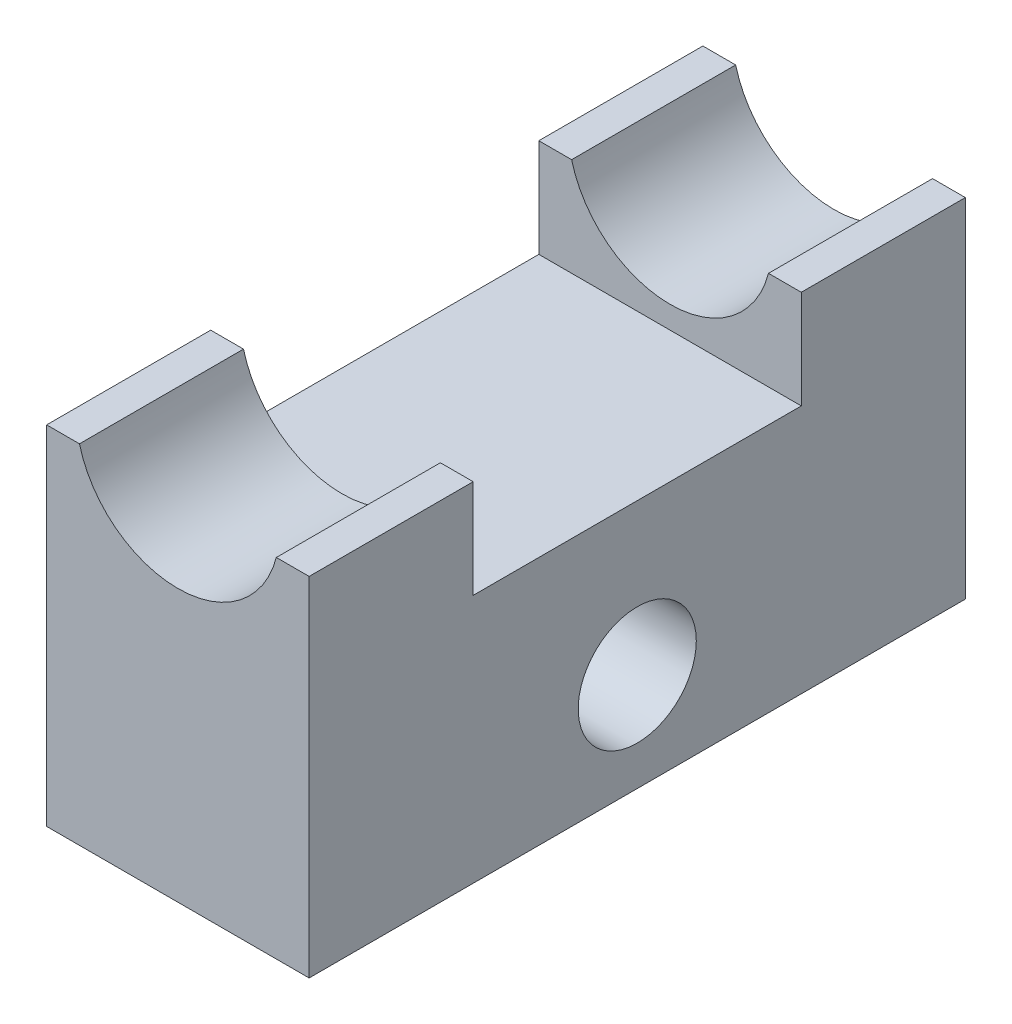
ISO-10303-21;
HEADER;
FILE_DESCRIPTION(('STEP AP214'),'2;1');
FILE_NAME('part.step','',(''),(''),'','','');
FILE_SCHEMA(('AUTOMOTIVE_DESIGN { 1 0 10303 214 1 1 1 1 }'));
ENDSEC;
DATA;
#1=APPLICATION_CONTEXT('core data for automotive mechanical design processes');
#2=APPLICATION_PROTOCOL_DEFINITION('international standard','automotive_design',2000,#1);
#3=PRODUCT_CONTEXT('',#1,'mechanical');
#4=PRODUCT('Part','Part','',(#3));
#5=PRODUCT_RELATED_PRODUCT_CATEGORY('part','',(#4));
#6=PRODUCT_DEFINITION_FORMATION('','',#4);
#7=PRODUCT_DEFINITION_CONTEXT('part definition',#1,'design');
#8=PRODUCT_DEFINITION('design','',#6,#7);
#9=PRODUCT_DEFINITION_SHAPE('','',#8);
#10=(LENGTH_UNIT() NAMED_UNIT(*) SI_UNIT(.MILLI.,.METRE.));
#11=(NAMED_UNIT(*) PLANE_ANGLE_UNIT() SI_UNIT($,.RADIAN.));
#12=(NAMED_UNIT(*) SI_UNIT($,.STERADIAN.) SOLID_ANGLE_UNIT());
#13=UNCERTAINTY_MEASURE_WITH_UNIT(LENGTH_MEASURE(1.E-05),#10,'distance_accuracy_value','');
#14=(GEOMETRIC_REPRESENTATION_CONTEXT(3) GLOBAL_UNCERTAINTY_ASSIGNED_CONTEXT((#13)) GLOBAL_UNIT_ASSIGNED_CONTEXT((#10,
#11,#12)) REPRESENTATION_CONTEXT('',''));
#15=CARTESIAN_POINT('',(0.,0.,0.));
#16=DIRECTION('',(0.,0.,1.));
#17=DIRECTION('',(1.,0.,0.));
#18=AXIS2_PLACEMENT_3D('',#15,#16,#17);
#19=CARTESIAN_POINT('',(1040.3924439915,375.619056085452,100.));
#20=DIRECTION('',(0.,-1.,0.));
#21=DIRECTION('',(0.,0.,-1.));
#22=AXIS2_PLACEMENT_3D('',#19,#20,#21);
#23=PLANE('',#22);
#24=DIRECTION('',(0.,0.,-1.));
#25=VECTOR('',#24,1.);
#26=CARTESIAN_POINT('',(1040.3924439915,375.619056085452,100.));
#27=LINE('',#26,#25);
#28=CARTESIAN_POINT('',(1040.3924439915,375.619056085452,100.));
#29=VERTEX_POINT('',#28);
#30=CARTESIAN_POINT('',(1040.3924439915,375.619056085452,75.));
#31=VERTEX_POINT('',#30);
#32=EDGE_CURVE('E159',#29,#31,#27,.T.);
#33=ORIENTED_EDGE('',*,*,#32,.T.);
#34=DIRECTION('',(1.,0.,0.));
#35=VECTOR('',#34,1.);
#36=CARTESIAN_POINT('',(940.392443991503,375.619056085452,75.));
#37=LINE('',#36,#35);
#38=CARTESIAN_POINT('',(1035.3924439915,375.619056085452,75.));
#39=VERTEX_POINT('',#38);
#40=EDGE_CURVE('E228',#39,#31,#37,.T.);
#41=ORIENTED_EDGE('',*,*,#40,.F.);
#42=DIRECTION('',(0.,0.,-1.));
#43=VECTOR('',#42,1.);
#44=CARTESIAN_POINT('',(1035.3924439915,375.619056085452,100.));
#45=LINE('',#44,#43);
#46=CARTESIAN_POINT('',(1035.3924439915,375.619056085452,100.));
#47=VERTEX_POINT('',#46);
#48=EDGE_CURVE('E156',#47,#39,#45,.T.);
#49=ORIENTED_EDGE('',*,*,#48,.F.);
#50=DIRECTION('',(-1.,0.,0.));
#51=VECTOR('',#50,1.);
#52=CARTESIAN_POINT('',(1040.3924439915,375.619056085452,100.));
#53=LINE('',#52,#51);
#54=EDGE_CURVE('E110',#29,#47,#53,.T.);
#55=ORIENTED_EDGE('',*,*,#54,.F.);
#56=EDGE_LOOP('',(#33,#41,#49,#55));
#57=FACE_BOUND('',#56,.T.);
#58=ADVANCED_FACE('F35',(#57),#23,.F.);
#59=CARTESIAN_POINT('',(1020.3924439915,379.524180923406,100.));
#60=DIRECTION('',(0.,0.,-1.));
#61=DIRECTION('',(-1.,0.,0.));
#62=AXIS2_PLACEMENT_3D('',#59,#60,#61);
#63=CYLINDRICAL_SURFACE('',#62,15.5000000000001);
#64=ORIENTED_EDGE('',*,*,#48,.T.);
#65=CARTESIAN_POINT('',(1020.3924439915,379.524180923406,75.));
#66=DIRECTION('',(0.,0.,1.));
#67=DIRECTION('',(0.,-1.,0.));
#68=AXIS2_PLACEMENT_3D('',#65,#66,#67);
#69=CIRCLE('',#68,15.5000000000001);
#70=CARTESIAN_POINT('',(1005.3924439915,375.619056085452,75.));
#71=VERTEX_POINT('',#70);
#72=EDGE_CURVE('E121',#39,#71,#69,.F.);
#73=ORIENTED_EDGE('',*,*,#72,.T.);
#74=DIRECTION('',(0.,0.,-1.));
#75=VECTOR('',#74,1.);
#76=CARTESIAN_POINT('',(1005.3924439915,375.619056085452,100.));
#77=LINE('',#76,#75);
#78=CARTESIAN_POINT('',(1005.3924439915,375.619056085452,100.));
#79=VERTEX_POINT('',#78);
#80=EDGE_CURVE('E117',#79,#71,#77,.T.);
#81=ORIENTED_EDGE('',*,*,#80,.F.);
#82=CARTESIAN_POINT('',(1020.3924439915,379.524180923406,100.));
#83=DIRECTION('',(0.,0.,-1.));
#84=DIRECTION('',(1.,0.,0.));
#85=AXIS2_PLACEMENT_3D('',#82,#83,#84);
#86=CIRCLE('',#85,15.5000000000001);
#87=EDGE_CURVE('E103',#47,#79,#86,.T.);
#88=ORIENTED_EDGE('',*,*,#87,.F.);
#89=EDGE_LOOP('',(#64,#73,#81,#88));
#90=FACE_BOUND('',#89,.T.);
#91=ADVANCED_FACE('F118',(#90),#63,.F.);
#92=CARTESIAN_POINT('',(1005.3924439915,375.619056085452,100.));
#93=DIRECTION('',(0.,-1.,0.));
#94=DIRECTION('',(0.,0.,-1.));
#95=AXIS2_PLACEMENT_3D('',#92,#93,#94);
#96=PLANE('',#95);
#97=ORIENTED_EDGE('',*,*,#80,.T.);
#98=CARTESIAN_POINT('',(1000.3924439915,375.619056085452,75.));
#99=VERTEX_POINT('',#98);
#100=EDGE_CURVE('E236',#99,#71,#37,.T.);
#101=ORIENTED_EDGE('',*,*,#100,.F.);
#102=DIRECTION('',(0.,0.,-1.));
#103=VECTOR('',#102,1.);
#104=CARTESIAN_POINT('',(1000.3924439915,375.619056085452,100.));
#105=LINE('',#104,#103);
#106=CARTESIAN_POINT('',(1000.3924439915,375.619056085452,100.));
#107=VERTEX_POINT('',#106);
#108=EDGE_CURVE('E129',#107,#99,#105,.T.);
#109=ORIENTED_EDGE('',*,*,#108,.F.);
#110=DIRECTION('',(-1.,0.,0.));
#111=VECTOR('',#110,1.);
#112=CARTESIAN_POINT('',(1005.3924439915,375.619056085452,100.));
#113=LINE('',#112,#111);
#114=EDGE_CURVE('E107',#79,#107,#113,.T.);
#115=ORIENTED_EDGE('',*,*,#114,.F.);
#116=EDGE_LOOP('',(#97,#101,#109,#115));
#117=FACE_BOUND('',#116,.T.);
#118=ADVANCED_FACE('F127',(#117),#96,.F.);
#119=CARTESIAN_POINT('',(1000.3924439915,322.619056085452,100.));
#120=DIRECTION('',(0.,1.,0.));
#121=DIRECTION('',(0.,0.,1.));
#122=AXIS2_PLACEMENT_3D('',#119,#120,#121);
#123=PLANE('',#122);
#124=DIRECTION('',(1.,0.,0.));
#125=VECTOR('',#124,1.);
#126=CARTESIAN_POINT('',(1000.3924439915,322.619056085452,0.));
#127=LINE('',#126,#125);
#128=CARTESIAN_POINT('',(1000.3924439915,322.619056085452,0.));
#129=VERTEX_POINT('',#128);
#130=CARTESIAN_POINT('',(1040.3924439915,322.619056085452,0.));
#131=VERTEX_POINT('',#130);
#132=EDGE_CURVE('E135',#129,#131,#127,.T.);
#133=ORIENTED_EDGE('',*,*,#132,.T.);
#134=DIRECTION('',(0.,0.,-1.));
#135=VECTOR('',#134,1.);
#136=CARTESIAN_POINT('',(1040.3924439915,322.619056085452,100.));
#137=LINE('',#136,#135);
#138=CARTESIAN_POINT('',(1040.3924439915,322.619056085452,100.));
#139=VERTEX_POINT('',#138);
#140=EDGE_CURVE('E162',#139,#131,#137,.T.);
#141=ORIENTED_EDGE('',*,*,#140,.F.);
#142=DIRECTION('',(1.,0.,0.));
#143=VECTOR('',#142,1.);
#144=CARTESIAN_POINT('',(1000.3924439915,322.619056085452,100.));
#145=LINE('',#144,#143);
#146=CARTESIAN_POINT('',(1000.3924439915,322.619056085452,100.));
#147=VERTEX_POINT('',#146);
#148=EDGE_CURVE('E152',#147,#139,#145,.T.);
#149=ORIENTED_EDGE('',*,*,#148,.F.);
#150=DIRECTION('',(0.,0.,-1.));
#151=VECTOR('',#150,1.);
#152=CARTESIAN_POINT('',(1000.3924439915,322.619056085452,100.));
#153=LINE('',#152,#151);
#154=EDGE_CURVE('E131',#147,#129,#153,.T.);
#155=ORIENTED_EDGE('',*,*,#154,.T.);
#156=EDGE_LOOP('',(#133,#141,#149,#155));
#157=FACE_BOUND('',#156,.T.);
#158=ADVANCED_FACE('F37',(#157),#123,.F.);
#159=CARTESIAN_POINT('',(1040.3924439915,322.619056085452,100.));
#160=DIRECTION('',(-1.,0.,0.));
#161=DIRECTION('',(0.,0.,1.));
#162=AXIS2_PLACEMENT_3D('',#159,#160,#161);
#163=PLANE('',#162);
#164=CARTESIAN_POINT('',(1040.3924439915,337.619056085452,50.));
#165=DIRECTION('',(1.,0.,0.));
#166=DIRECTION('',(0.,0.,-1.));
#167=AXIS2_PLACEMENT_3D('',#164,#165,#166);
#168=CIRCLE('',#167,9.00000000000001);
#169=CARTESIAN_POINT('',(1040.3924439915,337.619056085452,41.));
#170=VERTEX_POINT('',#169);
#171=EDGE_CURVE('E167',#170,#170,#168,.T.);
#172=ORIENTED_EDGE('',*,*,#171,.F.);
#173=EDGE_LOOP('',(#172));
#174=FACE_BOUND('',#173,.T.);
#175=DIRECTION('',(0.,0.,-1.));
#176=VECTOR('',#175,1.);
#177=CARTESIAN_POINT('',(1040.3924439915,360.619056085452,75.));
#178=LINE('',#177,#176);
#179=CARTESIAN_POINT('',(1040.3924439915,360.619056085452,75.));
#180=VERTEX_POINT('',#179);
#181=CARTESIAN_POINT('',(1040.3924439915,360.619056085452,25.));
#182=VERTEX_POINT('',#181);
#183=EDGE_CURVE('E220',#180,#182,#178,.T.);
#184=ORIENTED_EDGE('',*,*,#183,.F.);
#185=DIRECTION('',(0.,-1.,0.));
#186=VECTOR('',#185,1.);
#187=CARTESIAN_POINT('',(1040.3924439915,375.619056085452,75.));
#188=LINE('',#187,#186);
#189=EDGE_CURVE('E225',#31,#180,#188,.T.);
#190=ORIENTED_EDGE('',*,*,#189,.F.);
#191=ORIENTED_EDGE('',*,*,#32,.F.);
#192=DIRECTION('',(0.,1.,0.));
#193=VECTOR('',#192,1.);
#194=CARTESIAN_POINT('',(1040.3924439915,322.619056085452,100.));
#195=LINE('',#194,#193);
#196=EDGE_CURVE('E94',#139,#29,#195,.T.);
#197=ORIENTED_EDGE('',*,*,#196,.F.);
#198=ORIENTED_EDGE('',*,*,#140,.T.);
#199=DIRECTION('',(0.,1.,0.));
#200=VECTOR('',#199,1.);
#201=CARTESIAN_POINT('',(1040.3924439915,322.619056085452,0.));
#202=LINE('',#201,#200);
#203=CARTESIAN_POINT('',(1040.3924439915,375.619056085452,0.));
#204=VERTEX_POINT('',#203);
#205=EDGE_CURVE('E138',#131,#204,#202,.T.);
#206=ORIENTED_EDGE('',*,*,#205,.T.);
#207=CARTESIAN_POINT('',(1040.3924439915,375.619056085452,25.));
#208=VERTEX_POINT('',#207);
#209=EDGE_CURVE('E158',#208,#204,#27,.T.);
#210=ORIENTED_EDGE('',*,*,#209,.F.);
#211=DIRECTION('',(0.,1.,0.));
#212=VECTOR('',#211,1.);
#213=CARTESIAN_POINT('',(1040.3924439915,375.619056085452,25.));
#214=LINE('',#213,#212);
#215=EDGE_CURVE('E222',#182,#208,#214,.T.);
#216=ORIENTED_EDGE('',*,*,#215,.F.);
#217=EDGE_LOOP('',(#184,#190,#191,#197,#198,#206,#210,#216));
#218=FACE_BOUND('',#217,.T.);
#219=ADVANCED_FACE('F230',(#174,#218),#163,.F.);
#220=CARTESIAN_POINT('',(1035.3924439915,375.619056085452,25.));
#221=VERTEX_POINT('',#220);
#222=CARTESIAN_POINT('',(1035.3924439915,375.619056085452,0.));
#223=VERTEX_POINT('',#222);
#224=EDGE_CURVE('E124',#221,#223,#45,.T.);
#225=ORIENTED_EDGE('',*,*,#224,.F.);
#226=DIRECTION('',(1.,0.,0.));
#227=VECTOR('',#226,1.);
#228=CARTESIAN_POINT('',(940.392443991503,375.619056085452,25.));
#229=LINE('',#228,#227);
#230=EDGE_CURVE('E237',#221,#208,#229,.T.);
#231=ORIENTED_EDGE('',*,*,#230,.T.);
#232=ORIENTED_EDGE('',*,*,#209,.T.);
#233=DIRECTION('',(-1.,0.,0.));
#234=VECTOR('',#233,1.);
#235=CARTESIAN_POINT('',(1040.3924439915,375.619056085452,0.));
#236=LINE('',#235,#234);
#237=EDGE_CURVE('E142',#204,#223,#236,.T.);
#238=ORIENTED_EDGE('',*,*,#237,.T.);
#239=EDGE_LOOP('',(#225,#231,#232,#238));
#240=FACE_BOUND('',#239,.T.);
#241=ADVANCED_FACE('F251',(#240),#23,.F.);
#242=CARTESIAN_POINT('',(1005.3924439915,375.619056085452,25.));
#243=VERTEX_POINT('',#242);
#244=CARTESIAN_POINT('',(1005.3924439915,375.619056085452,0.));
#245=VERTEX_POINT('',#244);
#246=EDGE_CURVE('E125',#243,#245,#77,.T.);
#247=ORIENTED_EDGE('',*,*,#246,.F.);
#248=CARTESIAN_POINT('',(1020.3924439915,379.524180923406,25.));
#249=DIRECTION('',(0.,0.,-1.));
#250=DIRECTION('',(-1.,0.,0.));
#251=AXIS2_PLACEMENT_3D('',#248,#249,#250);
#252=CIRCLE('',#251,15.5000000000001);
#253=EDGE_CURVE('E241',#243,#221,#252,.F.);
#254=ORIENTED_EDGE('',*,*,#253,.T.);
#255=ORIENTED_EDGE('',*,*,#224,.T.);
#256=CARTESIAN_POINT('',(1020.3924439915,379.524180923406,0.));
#257=DIRECTION('',(0.,0.,-1.));
#258=DIRECTION('',(1.,0.,0.));
#259=AXIS2_PLACEMENT_3D('',#256,#257,#258);
#260=CIRCLE('',#259,15.5000000000001);
#261=EDGE_CURVE('E145',#223,#245,#260,.T.);
#262=ORIENTED_EDGE('',*,*,#261,.T.);
#263=EDGE_LOOP('',(#247,#254,#255,#262));
#264=FACE_BOUND('',#263,.T.);
#265=ADVANCED_FACE('F256',(#264),#63,.F.);
#266=CARTESIAN_POINT('',(1000.3924439915,375.619056085452,25.));
#267=VERTEX_POINT('',#266);
#268=CARTESIAN_POINT('',(1000.3924439915,375.619056085452,0.));
#269=VERTEX_POINT('',#268);
#270=EDGE_CURVE('E154',#267,#269,#105,.T.);
#271=ORIENTED_EDGE('',*,*,#270,.F.);
#272=EDGE_CURVE('E182',#267,#243,#229,.T.);
#273=ORIENTED_EDGE('',*,*,#272,.T.);
#274=ORIENTED_EDGE('',*,*,#246,.T.);
#275=DIRECTION('',(-1.,0.,0.));
#276=VECTOR('',#275,1.);
#277=CARTESIAN_POINT('',(1005.3924439915,375.619056085452,0.));
#278=LINE('',#277,#276);
#279=EDGE_CURVE('E148',#245,#269,#278,.T.);
#280=ORIENTED_EDGE('',*,*,#279,.T.);
#281=EDGE_LOOP('',(#271,#273,#274,#280));
#282=FACE_BOUND('',#281,.T.);
#283=ADVANCED_FACE('F181',(#282),#96,.F.);
#284=CARTESIAN_POINT('',(1000.3924439915,375.619056085452,100.));
#285=DIRECTION('',(1.,0.,0.));
#286=DIRECTION('',(0.,0.,-1.));
#287=AXIS2_PLACEMENT_3D('',#284,#285,#286);
#288=PLANE('',#287);
#289=ORIENTED_EDGE('',*,*,#108,.T.);
#290=DIRECTION('',(0.,-1.,0.));
#291=VECTOR('',#290,1.);
#292=CARTESIAN_POINT('',(1000.3924439915,375.619056085452,75.));
#293=LINE('',#292,#291);
#294=CARTESIAN_POINT('',(1000.3924439915,360.619056085452,75.));
#295=VERTEX_POINT('',#294);
#296=EDGE_CURVE('E11',#99,#295,#293,.T.);
#297=ORIENTED_EDGE('',*,*,#296,.T.);
#298=DIRECTION('',(0.,0.,-1.));
#299=VECTOR('',#298,1.);
#300=CARTESIAN_POINT('',(1000.3924439915,360.619056085452,100.));
#301=LINE('',#300,#299);
#302=CARTESIAN_POINT('',(1000.3924439915,360.619056085452,25.));
#303=VERTEX_POINT('',#302);
#304=EDGE_CURVE('E164',#295,#303,#301,.T.);
#305=ORIENTED_EDGE('',*,*,#304,.T.);
#306=DIRECTION('',(0.,1.,0.));
#307=VECTOR('',#306,1.);
#308=CARTESIAN_POINT('',(1000.3924439915,375.619056085452,25.));
#309=LINE('',#308,#307);
#310=EDGE_CURVE('E43',#303,#267,#309,.T.);
#311=ORIENTED_EDGE('',*,*,#310,.T.);
#312=ORIENTED_EDGE('',*,*,#270,.T.);
#313=DIRECTION('',(0.,-1.,0.));
#314=VECTOR('',#313,1.);
#315=CARTESIAN_POINT('',(1000.3924439915,375.619056085452,0.));
#316=LINE('',#315,#314);
#317=EDGE_CURVE('E85',#269,#129,#316,.T.);
#318=ORIENTED_EDGE('',*,*,#317,.T.);
#319=ORIENTED_EDGE('',*,*,#154,.F.);
#320=DIRECTION('',(0.,-1.,0.));
#321=VECTOR('',#320,1.);
#322=CARTESIAN_POINT('',(1000.3924439915,375.619056085452,100.));
#323=LINE('',#322,#321);
#324=EDGE_CURVE('E59',#107,#147,#323,.T.);
#325=ORIENTED_EDGE('',*,*,#324,.F.);
#326=EDGE_LOOP('',(#289,#297,#305,#311,#312,#318,#319,#325));
#327=FACE_BOUND('',#326,.T.);
#328=CARTESIAN_POINT('',(1000.3924439915,337.619056085452,50.));
#329=DIRECTION('',(1.,0.,0.));
#330=DIRECTION('',(0.,0.,-1.));
#331=AXIS2_PLACEMENT_3D('',#328,#329,#330);
#332=CIRCLE('',#331,9.00000000000001);
#333=CARTESIAN_POINT('',(1000.3924439915,337.619056085452,41.));
#334=VERTEX_POINT('',#333);
#335=EDGE_CURVE('E139',#334,#334,#332,.T.);
#336=ORIENTED_EDGE('',*,*,#335,.T.);
#337=EDGE_LOOP('',(#336));
#338=FACE_BOUND('',#337,.T.);
#339=ADVANCED_FACE('F172',(#327,#338),#288,.F.);
#340=CARTESIAN_POINT('',(1020.3924439915,379.524180923406,100.));
#341=DIRECTION('',(0.,0.,1.));
#342=DIRECTION('',(1.,0.,0.));
#343=AXIS2_PLACEMENT_3D('',#340,#341,#342);
#344=PLANE('',#343);
#345=ORIENTED_EDGE('',*,*,#148,.T.);
#346=ORIENTED_EDGE('',*,*,#196,.T.);
#347=ORIENTED_EDGE('',*,*,#54,.T.);
#348=ORIENTED_EDGE('',*,*,#87,.T.);
#349=ORIENTED_EDGE('',*,*,#114,.T.);
#350=ORIENTED_EDGE('',*,*,#324,.T.);
#351=EDGE_LOOP('',(#345,#346,#347,#348,#349,#350));
#352=FACE_BOUND('',#351,.T.);
#353=ADVANCED_FACE('F105',(#352),#344,.T.);
#354=CARTESIAN_POINT('',(1020.3924439915,379.524180923406,0.));
#355=DIRECTION('',(0.,0.,1.));
#356=DIRECTION('',(1.,0.,0.));
#357=AXIS2_PLACEMENT_3D('',#354,#355,#356);
#358=PLANE('',#357);
#359=ORIENTED_EDGE('',*,*,#132,.F.);
#360=ORIENTED_EDGE('',*,*,#317,.F.);
#361=ORIENTED_EDGE('',*,*,#279,.F.);
#362=ORIENTED_EDGE('',*,*,#261,.F.);
#363=ORIENTED_EDGE('',*,*,#237,.F.);
#364=ORIENTED_EDGE('',*,*,#205,.F.);
#365=EDGE_LOOP('',(#359,#360,#361,#362,#363,#364));
#366=FACE_BOUND('',#365,.T.);
#367=ADVANCED_FACE('F188',(#366),#358,.F.);
#368=CARTESIAN_POINT('',(940.392443991503,337.619056085452,50.));
#369=DIRECTION('',(1.,0.,0.));
#370=DIRECTION('',(0.,0.,-1.));
#371=AXIS2_PLACEMENT_3D('',#368,#369,#370);
#372=CYLINDRICAL_SURFACE('',#371,9.00000000000001);
#373=ORIENTED_EDGE('',*,*,#171,.T.);
#374=EDGE_LOOP('',(#373));
#375=FACE_BOUND('',#374,.T.);
#376=ORIENTED_EDGE('',*,*,#335,.F.);
#377=EDGE_LOOP('',(#376));
#378=FACE_BOUND('',#377,.T.);
#379=ADVANCED_FACE('F274',(#375,#378),#372,.F.);
#380=CARTESIAN_POINT('',(940.392443991503,375.619056085452,75.));
#381=DIRECTION('',(0.,0.,1.));
#382=DIRECTION('',(0.,-1.,0.));
#383=AXIS2_PLACEMENT_3D('',#380,#381,#382);
#384=PLANE('',#383);
#385=ORIENTED_EDGE('',*,*,#40,.T.);
#386=ORIENTED_EDGE('',*,*,#189,.T.);
#387=DIRECTION('',(1.,0.,0.));
#388=VECTOR('',#387,1.);
#389=CARTESIAN_POINT('',(940.392443991503,360.619056085452,75.));
#390=LINE('',#389,#388);
#391=EDGE_CURVE('E216',#295,#180,#390,.T.);
#392=ORIENTED_EDGE('',*,*,#391,.F.);
#393=ORIENTED_EDGE('',*,*,#296,.F.);
#394=ORIENTED_EDGE('',*,*,#100,.T.);
#395=ORIENTED_EDGE('',*,*,#72,.F.);
#396=EDGE_LOOP('',(#385,#386,#392,#393,#394,#395));
#397=FACE_BOUND('',#396,.T.);
#398=ADVANCED_FACE('F226',(#397),#384,.F.);
#399=CARTESIAN_POINT('',(940.392443991503,375.619056085452,25.));
#400=DIRECTION('',(0.,0.,-1.));
#401=DIRECTION('',(-1.,0.,0.));
#402=AXIS2_PLACEMENT_3D('',#399,#400,#401);
#403=PLANE('',#402);
#404=ORIENTED_EDGE('',*,*,#272,.F.);
#405=ORIENTED_EDGE('',*,*,#310,.F.);
#406=DIRECTION('',(1.,0.,0.));
#407=VECTOR('',#406,1.);
#408=CARTESIAN_POINT('',(940.392443991503,360.619056085452,25.));
#409=LINE('',#408,#407);
#410=EDGE_CURVE('E50',#303,#182,#409,.T.);
#411=ORIENTED_EDGE('',*,*,#410,.T.);
#412=ORIENTED_EDGE('',*,*,#215,.T.);
#413=ORIENTED_EDGE('',*,*,#230,.F.);
#414=ORIENTED_EDGE('',*,*,#253,.F.);
#415=EDGE_LOOP('',(#404,#405,#411,#412,#413,#414));
#416=FACE_BOUND('',#415,.T.);
#417=ADVANCED_FACE('F266',(#416),#403,.F.);
#418=CARTESIAN_POINT('',(940.392443991503,360.619056085452,75.));
#419=DIRECTION('',(0.,-1.,0.));
#420=DIRECTION('',(0.,0.,-1.));
#421=AXIS2_PLACEMENT_3D('',#418,#419,#420);
#422=PLANE('',#421);
#423=ORIENTED_EDGE('',*,*,#391,.T.);
#424=ORIENTED_EDGE('',*,*,#183,.T.);
#425=ORIENTED_EDGE('',*,*,#410,.F.);
#426=ORIENTED_EDGE('',*,*,#304,.F.);
#427=EDGE_LOOP('',(#423,#424,#425,#426));
#428=FACE_BOUND('',#427,.T.);
#429=ADVANCED_FACE('F218',(#428),#422,.F.);
#430=CLOSED_SHELL('',(#58,#91,#118,#158,#219,#241,#265,#283,#339,#353,#367,#379,#398,#417,#429));
#431=MANIFOLD_SOLID_BREP('B2',#430);
#432=ADVANCED_BREP_SHAPE_REPRESENTATION('',(#18,#431),#14);
#433=SHAPE_DEFINITION_REPRESENTATION(#9,#432);
ENDSEC;
END-ISO-10303-21;
